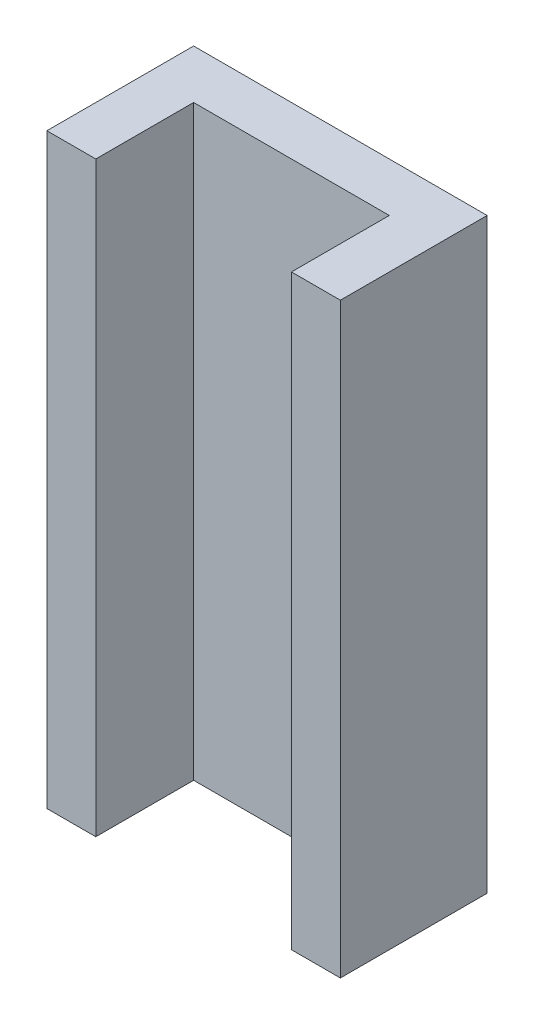
ISO-10303-21;
HEADER;
FILE_DESCRIPTION(('STEP AP214'),'2;1');
FILE_NAME('part.step','',(''),(''),'','','');
FILE_SCHEMA(('AUTOMOTIVE_DESIGN { 1 0 10303 214 1 1 1 1 }'));
ENDSEC;
DATA;
#1=APPLICATION_CONTEXT('core data for automotive mechanical design processes');
#2=APPLICATION_PROTOCOL_DEFINITION('international standard','automotive_design',2000,#1);
#3=PRODUCT_CONTEXT('',#1,'mechanical');
#4=PRODUCT('Part','Part','',(#3));
#5=PRODUCT_RELATED_PRODUCT_CATEGORY('part','',(#4));
#6=PRODUCT_DEFINITION_FORMATION('','',#4);
#7=PRODUCT_DEFINITION_CONTEXT('part definition',#1,'design');
#8=PRODUCT_DEFINITION('design','',#6,#7);
#9=PRODUCT_DEFINITION_SHAPE('','',#8);
#10=(LENGTH_UNIT() NAMED_UNIT(*) SI_UNIT(.MILLI.,.METRE.));
#11=(NAMED_UNIT(*) PLANE_ANGLE_UNIT() SI_UNIT($,.RADIAN.));
#12=(NAMED_UNIT(*) SI_UNIT($,.STERADIAN.) SOLID_ANGLE_UNIT());
#13=UNCERTAINTY_MEASURE_WITH_UNIT(LENGTH_MEASURE(1.E-05),#10,'distance_accuracy_value','');
#14=(GEOMETRIC_REPRESENTATION_CONTEXT(3) GLOBAL_UNCERTAINTY_ASSIGNED_CONTEXT((#13)) GLOBAL_UNIT_ASSIGNED_CONTEXT((#10,
#11,#12)) REPRESENTATION_CONTEXT('',''));
#15=CARTESIAN_POINT('',(0.,0.,0.));
#16=DIRECTION('',(0.,0.,1.));
#17=DIRECTION('',(1.,0.,0.));
#18=AXIS2_PLACEMENT_3D('',#15,#16,#17);
#19=CARTESIAN_POINT('',(-19.05,38.1,0.));
#20=DIRECTION('',(1.,0.,0.));
#21=DIRECTION('',(0.,0.,-1.));
#22=AXIS2_PLACEMENT_3D('',#19,#20,#21);
#23=PLANE('',#22);
#24=DIRECTION('',(0.,0.,1.));
#25=VECTOR('',#24,1.);
#26=CARTESIAN_POINT('',(-19.05,-38.1,0.));
#27=LINE('',#26,#25);
#28=CARTESIAN_POINT('',(-19.05,-38.1,-19.05));
#29=VERTEX_POINT('',#28);
#30=CARTESIAN_POINT('',(-19.05,-38.1,0.));
#31=VERTEX_POINT('',#30);
#32=EDGE_CURVE('E142',#29,#31,#27,.T.);
#33=ORIENTED_EDGE('',*,*,#32,.T.);
#34=DIRECTION('',(0.,-1.,0.));
#35=VECTOR('',#34,1.);
#36=CARTESIAN_POINT('',(-19.05,38.1,0.));
#37=LINE('',#36,#35);
#38=CARTESIAN_POINT('',(-19.05,38.1,0.));
#39=VERTEX_POINT('',#38);
#40=EDGE_CURVE('E11',#39,#31,#37,.T.);
#41=ORIENTED_EDGE('',*,*,#40,.F.);
#42=DIRECTION('',(0.,0.,1.));
#43=VECTOR('',#42,1.);
#44=CARTESIAN_POINT('',(-19.05,38.1,0.));
#45=LINE('',#44,#43);
#46=CARTESIAN_POINT('',(-19.05,38.1,-19.05));
#47=VERTEX_POINT('',#46);
#48=EDGE_CURVE('E166',#47,#39,#45,.T.);
#49=ORIENTED_EDGE('',*,*,#48,.F.);
#50=DIRECTION('',(0.,-1.,0.));
#51=VECTOR('',#50,1.);
#52=CARTESIAN_POINT('',(-19.05,38.1,-19.05));
#53=LINE('',#52,#51);
#54=EDGE_CURVE('E56',#47,#29,#53,.T.);
#55=ORIENTED_EDGE('',*,*,#54,.T.);
#56=EDGE_LOOP('',(#33,#41,#49,#55));
#57=FACE_BOUND('',#56,.T.);
#58=ADVANCED_FACE('F39',(#57),#23,.F.);
#59=CARTESIAN_POINT('',(0.,38.1,0.));
#60=DIRECTION('',(0.,0.,-1.));
#61=DIRECTION('',(-1.,0.,0.));
#62=AXIS2_PLACEMENT_3D('',#59,#60,#61);
#63=PLANE('',#62);
#64=DIRECTION('',(1.,0.,0.));
#65=VECTOR('',#64,1.);
#66=CARTESIAN_POINT('',(0.,-38.1,0.));
#67=LINE('',#66,#65);
#68=CARTESIAN_POINT('',(-12.7,-38.1,0.));
#69=VERTEX_POINT('',#68);
#70=EDGE_CURVE('E145',#31,#69,#67,.T.);
#71=ORIENTED_EDGE('',*,*,#70,.T.);
#72=DIRECTION('',(0.,-1.,0.));
#73=VECTOR('',#72,1.);
#74=CARTESIAN_POINT('',(-12.7,38.1,0.));
#75=LINE('',#74,#73);
#76=CARTESIAN_POINT('',(-12.7,38.1,0.));
#77=VERTEX_POINT('',#76);
#78=EDGE_CURVE('E48',#77,#69,#75,.T.);
#79=ORIENTED_EDGE('',*,*,#78,.F.);
#80=DIRECTION('',(1.,0.,0.));
#81=VECTOR('',#80,1.);
#82=CARTESIAN_POINT('',(0.,38.1,0.));
#83=LINE('',#82,#81);
#84=EDGE_CURVE('E94',#39,#77,#83,.T.);
#85=ORIENTED_EDGE('',*,*,#84,.F.);
#86=ORIENTED_EDGE('',*,*,#40,.T.);
#87=EDGE_LOOP('',(#71,#79,#85,#86));
#88=FACE_BOUND('',#87,.T.);
#89=ADVANCED_FACE('F186',(#88),#63,.F.);
#90=CARTESIAN_POINT('',(-12.7,38.1,0.));
#91=DIRECTION('',(1.,0.,0.));
#92=DIRECTION('',(0.,0.,-1.));
#93=AXIS2_PLACEMENT_3D('',#90,#91,#92);
#94=PLANE('',#93);
#95=DIRECTION('',(0.,0.,1.));
#96=VECTOR('',#95,1.);
#97=CARTESIAN_POINT('',(-12.7,-38.1,0.));
#98=LINE('',#97,#96);
#99=CARTESIAN_POINT('',(-12.7,-38.1,-12.7));
#100=VERTEX_POINT('',#99);
#101=EDGE_CURVE('E149',#100,#69,#98,.T.);
#102=ORIENTED_EDGE('',*,*,#101,.F.);
#103=DIRECTION('',(0.,-1.,0.));
#104=VECTOR('',#103,1.);
#105=CARTESIAN_POINT('',(-12.7,38.1,-12.7));
#106=LINE('',#105,#104);
#107=CARTESIAN_POINT('',(-12.7,38.1,-12.7));
#108=VERTEX_POINT('',#107);
#109=EDGE_CURVE('E177',#108,#100,#106,.T.);
#110=ORIENTED_EDGE('',*,*,#109,.F.);
#111=DIRECTION('',(0.,0.,1.));
#112=VECTOR('',#111,1.);
#113=CARTESIAN_POINT('',(-12.7,38.1,0.));
#114=LINE('',#113,#112);
#115=EDGE_CURVE('E185',#108,#77,#114,.T.);
#116=ORIENTED_EDGE('',*,*,#115,.T.);
#117=ORIENTED_EDGE('',*,*,#78,.T.);
#118=EDGE_LOOP('',(#102,#110,#116,#117));
#119=FACE_BOUND('',#118,.T.);
#120=ADVANCED_FACE('F183',(#119),#94,.T.);
#121=CARTESIAN_POINT('',(0.,38.1,-12.7));
#122=DIRECTION('',(0.,0.,-1.));
#123=DIRECTION('',(-1.,0.,0.));
#124=AXIS2_PLACEMENT_3D('',#121,#122,#123);
#125=PLANE('',#124);
#126=DIRECTION('',(1.,0.,0.));
#127=VECTOR('',#126,1.);
#128=CARTESIAN_POINT('',(0.,-38.1,-12.7));
#129=LINE('',#128,#127);
#130=CARTESIAN_POINT('',(12.7,-38.1,-12.7));
#131=VERTEX_POINT('',#130);
#132=EDGE_CURVE('E153',#100,#131,#129,.T.);
#133=ORIENTED_EDGE('',*,*,#132,.T.);
#134=DIRECTION('',(0.,-1.,0.));
#135=VECTOR('',#134,1.);
#136=CARTESIAN_POINT('',(12.7,38.1,-12.7));
#137=LINE('',#136,#135);
#138=CARTESIAN_POINT('',(12.7,38.1,-12.7));
#139=VERTEX_POINT('',#138);
#140=EDGE_CURVE('E173',#139,#131,#137,.T.);
#141=ORIENTED_EDGE('',*,*,#140,.F.);
#142=DIRECTION('',(1.,0.,0.));
#143=VECTOR('',#142,1.);
#144=CARTESIAN_POINT('',(0.,38.1,-12.7));
#145=LINE('',#144,#143);
#146=EDGE_CURVE('E199',#108,#139,#145,.T.);
#147=ORIENTED_EDGE('',*,*,#146,.F.);
#148=ORIENTED_EDGE('',*,*,#109,.T.);
#149=EDGE_LOOP('',(#133,#141,#147,#148));
#150=FACE_BOUND('',#149,.T.);
#151=ADVANCED_FACE('F194',(#150),#125,.F.);
#152=CARTESIAN_POINT('',(12.7,38.1,0.));
#153=DIRECTION('',(1.,0.,0.));
#154=DIRECTION('',(0.,0.,-1.));
#155=AXIS2_PLACEMENT_3D('',#152,#153,#154);
#156=PLANE('',#155);
#157=DIRECTION('',(0.,0.,1.));
#158=VECTOR('',#157,1.);
#159=CARTESIAN_POINT('',(12.7,-38.1,0.));
#160=LINE('',#159,#158);
#161=CARTESIAN_POINT('',(12.7,-38.1,0.));
#162=VERTEX_POINT('',#161);
#163=EDGE_CURVE('E156',#131,#162,#160,.T.);
#164=ORIENTED_EDGE('',*,*,#163,.T.);
#165=DIRECTION('',(0.,-1.,0.));
#166=VECTOR('',#165,1.);
#167=CARTESIAN_POINT('',(12.7,38.1,0.));
#168=LINE('',#167,#166);
#169=CARTESIAN_POINT('',(12.7,38.1,0.));
#170=VERTEX_POINT('',#169);
#171=EDGE_CURVE('E131',#170,#162,#168,.T.);
#172=ORIENTED_EDGE('',*,*,#171,.F.);
#173=DIRECTION('',(0.,0.,1.));
#174=VECTOR('',#173,1.);
#175=CARTESIAN_POINT('',(12.7,38.1,0.));
#176=LINE('',#175,#174);
#177=EDGE_CURVE('E117',#139,#170,#176,.T.);
#178=ORIENTED_EDGE('',*,*,#177,.F.);
#179=ORIENTED_EDGE('',*,*,#140,.T.);
#180=EDGE_LOOP('',(#164,#172,#178,#179));
#181=FACE_BOUND('',#180,.T.);
#182=ADVANCED_FACE('F197',(#181),#156,.F.);
#183=CARTESIAN_POINT('',(19.05,-38.1,0.));
#184=VERTEX_POINT('',#183);
#185=EDGE_CURVE('E127',#162,#184,#67,.T.);
#186=ORIENTED_EDGE('',*,*,#185,.T.);
#187=DIRECTION('',(0.,-1.,0.));
#188=VECTOR('',#187,1.);
#189=CARTESIAN_POINT('',(19.05,38.1,0.));
#190=LINE('',#189,#188);
#191=CARTESIAN_POINT('',(19.05,38.1,0.));
#192=VERTEX_POINT('',#191);
#193=EDGE_CURVE('E124',#192,#184,#190,.T.);
#194=ORIENTED_EDGE('',*,*,#193,.F.);
#195=EDGE_CURVE('E110',#170,#192,#83,.T.);
#196=ORIENTED_EDGE('',*,*,#195,.F.);
#197=ORIENTED_EDGE('',*,*,#171,.T.);
#198=EDGE_LOOP('',(#186,#194,#196,#197));
#199=FACE_BOUND('',#198,.T.);
#200=ADVANCED_FACE('F125',(#199),#63,.F.);
#201=CARTESIAN_POINT('',(19.05,38.1,0.));
#202=DIRECTION('',(1.,0.,0.));
#203=DIRECTION('',(0.,0.,-1.));
#204=AXIS2_PLACEMENT_3D('',#201,#202,#203);
#205=PLANE('',#204);
#206=DIRECTION('',(0.,0.,1.));
#207=VECTOR('',#206,1.);
#208=CARTESIAN_POINT('',(19.05,-38.1,0.));
#209=LINE('',#208,#207);
#210=CARTESIAN_POINT('',(19.05,-38.1,-19.05));
#211=VERTEX_POINT('',#210);
#212=EDGE_CURVE('E159',#211,#184,#209,.T.);
#213=ORIENTED_EDGE('',*,*,#212,.F.);
#214=DIRECTION('',(0.,-1.,0.));
#215=VECTOR('',#214,1.);
#216=CARTESIAN_POINT('',(19.05,38.1,-19.05));
#217=LINE('',#216,#215);
#218=CARTESIAN_POINT('',(19.05,38.1,-19.05));
#219=VERTEX_POINT('',#218);
#220=EDGE_CURVE('E82',#219,#211,#217,.T.);
#221=ORIENTED_EDGE('',*,*,#220,.F.);
#222=DIRECTION('',(0.,0.,1.));
#223=VECTOR('',#222,1.);
#224=CARTESIAN_POINT('',(19.05,38.1,0.));
#225=LINE('',#224,#223);
#226=EDGE_CURVE('E115',#219,#192,#225,.T.);
#227=ORIENTED_EDGE('',*,*,#226,.T.);
#228=ORIENTED_EDGE('',*,*,#193,.T.);
#229=EDGE_LOOP('',(#213,#221,#227,#228));
#230=FACE_BOUND('',#229,.T.);
#231=ADVANCED_FACE('F133',(#230),#205,.T.);
#232=CARTESIAN_POINT('',(0.,38.1,-19.05));
#233=DIRECTION('',(0.,0.,-1.));
#234=DIRECTION('',(-1.,0.,0.));
#235=AXIS2_PLACEMENT_3D('',#232,#233,#234);
#236=PLANE('',#235);
#237=DIRECTION('',(1.,0.,0.));
#238=VECTOR('',#237,1.);
#239=CARTESIAN_POINT('',(0.,-38.1,-19.05));
#240=LINE('',#239,#238);
#241=EDGE_CURVE('E162',#29,#211,#240,.T.);
#242=ORIENTED_EDGE('',*,*,#241,.F.);
#243=ORIENTED_EDGE('',*,*,#54,.F.);
#244=DIRECTION('',(1.,0.,0.));
#245=VECTOR('',#244,1.);
#246=CARTESIAN_POINT('',(0.,38.1,-19.05));
#247=LINE('',#246,#245);
#248=EDGE_CURVE('E135',#47,#219,#247,.T.);
#249=ORIENTED_EDGE('',*,*,#248,.T.);
#250=ORIENTED_EDGE('',*,*,#220,.T.);
#251=EDGE_LOOP('',(#242,#243,#249,#250));
#252=FACE_BOUND('',#251,.T.);
#253=ADVANCED_FACE('F206',(#252),#236,.T.);
#254=CARTESIAN_POINT('',(0.,38.1,0.));
#255=DIRECTION('',(0.,1.,0.));
#256=DIRECTION('',(0.,0.,1.));
#257=AXIS2_PLACEMENT_3D('',#254,#255,#256);
#258=PLANE('',#257);
#259=ORIENTED_EDGE('',*,*,#48,.T.);
#260=ORIENTED_EDGE('',*,*,#84,.T.);
#261=ORIENTED_EDGE('',*,*,#115,.F.);
#262=ORIENTED_EDGE('',*,*,#146,.T.);
#263=ORIENTED_EDGE('',*,*,#177,.T.);
#264=ORIENTED_EDGE('',*,*,#195,.T.);
#265=ORIENTED_EDGE('',*,*,#226,.F.);
#266=ORIENTED_EDGE('',*,*,#248,.F.);
#267=EDGE_LOOP('',(#259,#260,#261,#262,#263,#264,#265,#266));
#268=FACE_BOUND('',#267,.T.);
#269=ADVANCED_FACE('F112',(#268),#258,.T.);
#270=CARTESIAN_POINT('',(0.,-38.1,0.));
#271=DIRECTION('',(0.,1.,0.));
#272=DIRECTION('',(0.,0.,1.));
#273=AXIS2_PLACEMENT_3D('',#270,#271,#272);
#274=PLANE('',#273);
#275=ORIENTED_EDGE('',*,*,#32,.F.);
#276=ORIENTED_EDGE('',*,*,#241,.T.);
#277=ORIENTED_EDGE('',*,*,#212,.T.);
#278=ORIENTED_EDGE('',*,*,#185,.F.);
#279=ORIENTED_EDGE('',*,*,#163,.F.);
#280=ORIENTED_EDGE('',*,*,#132,.F.);
#281=ORIENTED_EDGE('',*,*,#101,.T.);
#282=ORIENTED_EDGE('',*,*,#70,.F.);
#283=EDGE_LOOP('',(#275,#276,#277,#278,#279,#280,#281,#282));
#284=FACE_BOUND('',#283,.T.);
#285=ADVANCED_FACE('F190',(#284),#274,.F.);
#286=CLOSED_SHELL('',(#58,#89,#120,#151,#182,#200,#231,#253,#269,#285));
#287=MANIFOLD_SOLID_BREP('B2',#286);
#288=ADVANCED_BREP_SHAPE_REPRESENTATION('',(#18,#287),#14);
#289=SHAPE_DEFINITION_REPRESENTATION(#9,#288);
ENDSEC;
END-ISO-10303-21;
